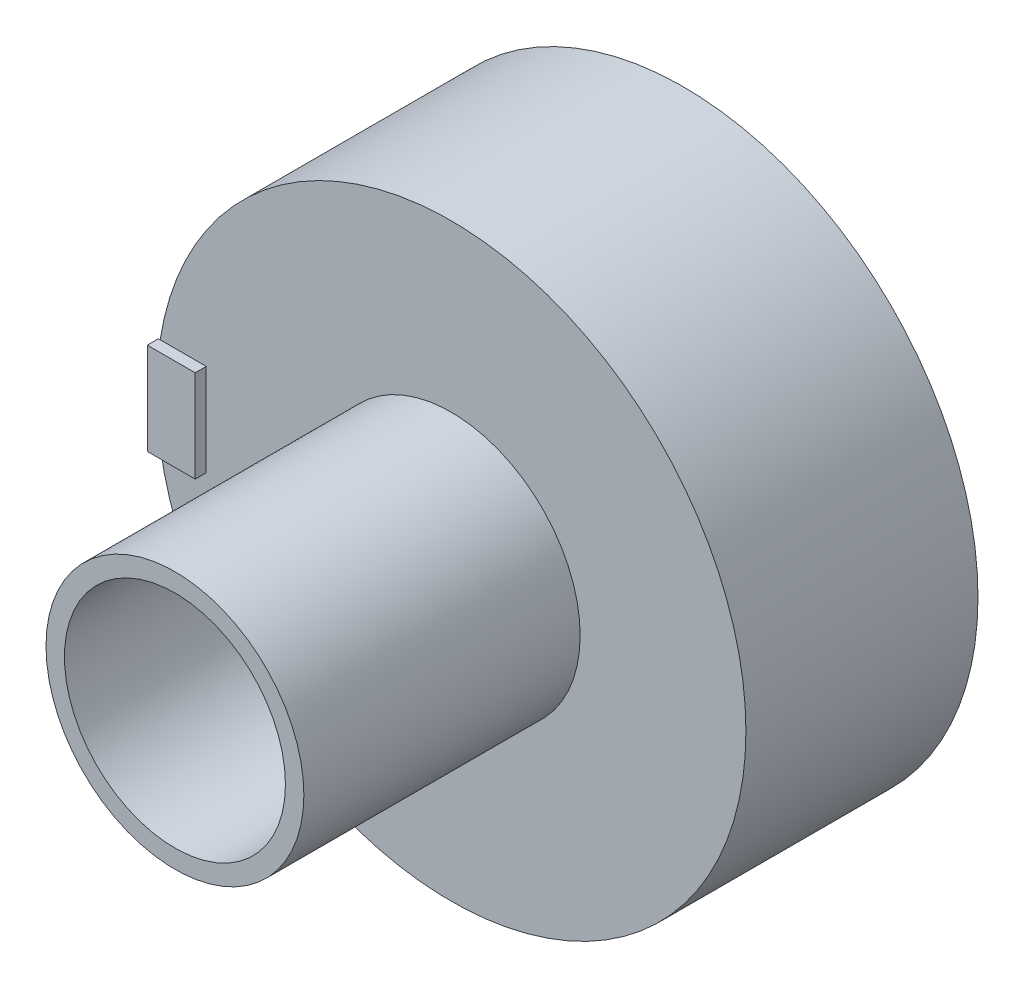
ISO-10303-21;
HEADER;
FILE_DESCRIPTION(('STEP AP214'),'2;1');
FILE_NAME('part.step','',(''),(''),'','','');
FILE_SCHEMA(('AUTOMOTIVE_DESIGN { 1 0 10303 214 1 1 1 1 }'));
ENDSEC;
DATA;
#1=APPLICATION_CONTEXT('core data for automotive mechanical design processes');
#2=APPLICATION_PROTOCOL_DEFINITION('international standard','automotive_design',2000,#1);
#3=PRODUCT_CONTEXT('',#1,'mechanical');
#4=PRODUCT('Part','Part','',(#3));
#5=PRODUCT_RELATED_PRODUCT_CATEGORY('part','',(#4));
#6=PRODUCT_DEFINITION_FORMATION('','',#4);
#7=PRODUCT_DEFINITION_CONTEXT('part definition',#1,'design');
#8=PRODUCT_DEFINITION('design','',#6,#7);
#9=PRODUCT_DEFINITION_SHAPE('','',#8);
#10=(LENGTH_UNIT() NAMED_UNIT(*) SI_UNIT(.MILLI.,.METRE.));
#11=(NAMED_UNIT(*) PLANE_ANGLE_UNIT() SI_UNIT($,.RADIAN.));
#12=(NAMED_UNIT(*) SI_UNIT($,.STERADIAN.) SOLID_ANGLE_UNIT());
#13=UNCERTAINTY_MEASURE_WITH_UNIT(LENGTH_MEASURE(1.E-05),#10,'distance_accuracy_value','');
#14=(GEOMETRIC_REPRESENTATION_CONTEXT(3) GLOBAL_UNCERTAINTY_ASSIGNED_CONTEXT((#13)) GLOBAL_UNIT_ASSIGNED_CONTEXT((#10,
#11,#12)) REPRESENTATION_CONTEXT('',''));
#15=CARTESIAN_POINT('',(0.,0.,0.));
#16=DIRECTION('',(0.,0.,1.));
#17=DIRECTION('',(1.,0.,0.));
#18=AXIS2_PLACEMENT_3D('',#15,#16,#17);
#19=CARTESIAN_POINT('',(0.,0.,6.3));
#20=DIRECTION('',(0.,0.,1.));
#21=DIRECTION('',(1.,0.,0.));
#22=AXIS2_PLACEMENT_3D('',#19,#20,#21);
#23=PLANE('',#22);
#24=CARTESIAN_POINT('',(0.,0.,6.3));
#25=DIRECTION('',(0.,0.,1.));
#26=DIRECTION('',(1.,0.,0.));
#27=AXIS2_PLACEMENT_3D('',#24,#25,#26);
#28=CIRCLE('',#27,8.);
#29=CARTESIAN_POINT('',(-7.95,0.893028554974594,6.3));
#30=VERTEX_POINT('',#29);
#31=CARTESIAN_POINT('',(-7.95,-0.893028554974605,6.3));
#32=VERTEX_POINT('',#31);
#33=EDGE_CURVE('E129',#30,#32,#28,.T.);
#34=ORIENTED_EDGE('',*,*,#33,.T.);
#35=DIRECTION('',(0.,1.,0.));
#36=VECTOR('',#35,1.);
#37=CARTESIAN_POINT('',(-7.95,0.,6.3));
#38=LINE('',#37,#36);
#39=EDGE_CURVE('E11',#32,#30,#38,.T.);
#40=ORIENTED_EDGE('',*,*,#39,.T.);
#41=EDGE_LOOP('',(#34,#40));
#42=FACE_BOUND('',#41,.T.);
#43=ADVANCED_FACE('F32',(#42),#23,.T.);
#44=CARTESIAN_POINT('',(0.,0.,6.3));
#45=DIRECTION('',(0.,0.,1.));
#46=DIRECTION('',(1.,0.,0.));
#47=AXIS2_PLACEMENT_3D('',#44,#45,#46);
#48=CIRCLE('',#47,3.5);
#49=CARTESIAN_POINT('',(3.5,0.,6.3));
#50=VERTEX_POINT('',#49);
#51=EDGE_CURVE('E120',#50,#50,#48,.T.);
#52=ORIENTED_EDGE('',*,*,#51,.F.);
#53=EDGE_LOOP('',(#52));
#54=FACE_BOUND('',#53,.T.);
#55=DIRECTION('',(0.,1.,0.));
#56=VECTOR('',#55,1.);
#57=CARTESIAN_POINT('',(-6.65,1.25,6.3));
#58=LINE('',#57,#56);
#59=CARTESIAN_POINT('',(-6.65,-1.25,6.3));
#60=VERTEX_POINT('',#59);
#61=CARTESIAN_POINT('',(-6.65,1.25,6.3));
#62=VERTEX_POINT('',#61);
#63=EDGE_CURVE('E140',#60,#62,#58,.T.);
#64=ORIENTED_EDGE('',*,*,#63,.F.);
#65=DIRECTION('',(-1.,0.,0.));
#66=VECTOR('',#65,1.);
#67=CARTESIAN_POINT('',(0.,-1.25,6.3));
#68=LINE('',#67,#66);
#69=CARTESIAN_POINT('',(-7.90174031463955,-1.25,6.3));
#70=VERTEX_POINT('',#69);
#71=EDGE_CURVE('E40',#60,#70,#68,.T.);
#72=ORIENTED_EDGE('',*,*,#71,.T.);
#73=CARTESIAN_POINT('',(-7.90174031463955,1.25,6.3));
#74=VERTEX_POINT('',#73);
#75=EDGE_CURVE('E130',#70,#74,#28,.T.);
#76=ORIENTED_EDGE('',*,*,#75,.T.);
#77=DIRECTION('',(-1.,0.,0.));
#78=VECTOR('',#77,1.);
#79=CARTESIAN_POINT('',(-7.95,1.25,6.3));
#80=LINE('',#79,#78);
#81=EDGE_CURVE('E106',#62,#74,#80,.T.);
#82=ORIENTED_EDGE('',*,*,#81,.F.);
#83=EDGE_LOOP('',(#64,#72,#76,#82));
#84=FACE_BOUND('',#83,.T.);
#85=ADVANCED_FACE('F137',(#54,#84),#23,.T.);
#86=CARTESIAN_POINT('',(0.,0.,6.3));
#87=DIRECTION('',(0.,0.,-1.));
#88=DIRECTION('',(-1.,0.,0.));
#89=AXIS2_PLACEMENT_3D('',#86,#87,#88);
#90=CYLINDRICAL_SURFACE('',#89,8.);
#91=EDGE_CURVE('E127',#74,#30,#28,.T.);
#92=ORIENTED_EDGE('',*,*,#91,.F.);
#93=ORIENTED_EDGE('',*,*,#75,.F.);
#94=EDGE_CURVE('E145',#32,#70,#28,.T.);
#95=ORIENTED_EDGE('',*,*,#94,.F.);
#96=ORIENTED_EDGE('',*,*,#33,.F.);
#97=EDGE_LOOP('',(#92,#93,#95,#96));
#98=FACE_BOUND('',#97,.T.);
#99=CARTESIAN_POINT('',(0.,0.,0.));
#100=DIRECTION('',(0.,0.,1.));
#101=DIRECTION('',(1.,0.,0.));
#102=AXIS2_PLACEMENT_3D('',#99,#100,#101);
#103=CIRCLE('',#102,8.);
#104=CARTESIAN_POINT('',(8.,0.,0.));
#105=VERTEX_POINT('',#104);
#106=EDGE_CURVE('E124',#105,#105,#103,.T.);
#107=ORIENTED_EDGE('',*,*,#106,.T.);
#108=EDGE_LOOP('',(#107));
#109=FACE_BOUND('',#108,.T.);
#110=ADVANCED_FACE('F34',(#98,#109),#90,.T.);
#111=CARTESIAN_POINT('',(0.,0.,0.));
#112=DIRECTION('',(0.,0.,1.));
#113=DIRECTION('',(1.,0.,0.));
#114=AXIS2_PLACEMENT_3D('',#111,#112,#113);
#115=PLANE('',#114);
#116=ORIENTED_EDGE('',*,*,#106,.F.);
#117=EDGE_LOOP('',(#116));
#118=FACE_BOUND('',#117,.T.);
#119=ADVANCED_FACE('F189',(#118),#115,.F.);
#120=CARTESIAN_POINT('',(0.,0.,13.8));
#121=DIRECTION('',(0.,0.,-1.));
#122=DIRECTION('',(-1.,0.,0.));
#123=AXIS2_PLACEMENT_3D('',#120,#121,#122);
#124=CYLINDRICAL_SURFACE('',#123,3.5);
#125=CARTESIAN_POINT('',(0.,0.,13.8));
#126=DIRECTION('',(0.,0.,1.));
#127=DIRECTION('',(1.,0.,0.));
#128=AXIS2_PLACEMENT_3D('',#125,#126,#127);
#129=CIRCLE('',#128,3.5);
#130=CARTESIAN_POINT('',(3.5,0.,13.8));
#131=VERTEX_POINT('',#130);
#132=EDGE_CURVE('E121',#131,#131,#129,.T.);
#133=ORIENTED_EDGE('',*,*,#132,.F.);
#134=EDGE_LOOP('',(#133));
#135=FACE_BOUND('',#134,.T.);
#136=ORIENTED_EDGE('',*,*,#51,.T.);
#137=EDGE_LOOP('',(#136));
#138=FACE_BOUND('',#137,.T.);
#139=ADVANCED_FACE('F187',(#135,#138),#124,.T.);
#140=CARTESIAN_POINT('',(0.,0.,13.8));
#141=DIRECTION('',(0.,0.,1.));
#142=DIRECTION('',(1.,0.,0.));
#143=AXIS2_PLACEMENT_3D('',#140,#141,#142);
#144=PLANE('',#143);
#145=CARTESIAN_POINT('',(0.,0.,13.8));
#146=DIRECTION('',(0.,0.,1.));
#147=DIRECTION('',(1.,0.,0.));
#148=AXIS2_PLACEMENT_3D('',#145,#146,#147);
#149=CIRCLE('',#148,3.);
#150=CARTESIAN_POINT('',(3.,0.,13.8));
#151=VERTEX_POINT('',#150);
#152=EDGE_CURVE('E110',#151,#151,#149,.T.);
#153=ORIENTED_EDGE('',*,*,#152,.F.);
#154=EDGE_LOOP('',(#153));
#155=FACE_BOUND('',#154,.T.);
#156=ORIENTED_EDGE('',*,*,#132,.T.);
#157=EDGE_LOOP('',(#156));
#158=FACE_BOUND('',#157,.T.);
#159=ADVANCED_FACE('F196',(#155,#158),#144,.T.);
#160=CARTESIAN_POINT('',(0.,0.,-2.18528137423857));
#161=DIRECTION('',(0.,0.,1.));
#162=DIRECTION('',(1.,0.,0.));
#163=AXIS2_PLACEMENT_3D('',#160,#161,#162);
#164=CYLINDRICAL_SURFACE('',#163,3.);
#165=CARTESIAN_POINT('',(0.,0.,6.3));
#166=DIRECTION('',(0.,0.,1.));
#167=DIRECTION('',(1.,0.,0.));
#168=AXIS2_PLACEMENT_3D('',#165,#166,#167);
#169=CIRCLE('',#168,3.);
#170=CARTESIAN_POINT('',(3.,0.,6.3));
#171=VERTEX_POINT('',#170);
#172=EDGE_CURVE('E113',#171,#171,#169,.F.);
#173=ORIENTED_EDGE('',*,*,#172,.T.);
#174=EDGE_LOOP('',(#173));
#175=FACE_BOUND('',#174,.T.);
#176=ORIENTED_EDGE('',*,*,#152,.T.);
#177=EDGE_LOOP('',(#176));
#178=FACE_BOUND('',#177,.T.);
#179=ADVANCED_FACE('F174',(#175,#178),#164,.F.);
#180=CARTESIAN_POINT('',(0.,0.,6.3));
#181=DIRECTION('',(0.,0.,1.));
#182=DIRECTION('',(1.,0.,0.));
#183=AXIS2_PLACEMENT_3D('',#180,#181,#182);
#184=PLANE('',#183);
#185=ORIENTED_EDGE('',*,*,#172,.F.);
#186=EDGE_LOOP('',(#185));
#187=FACE_BOUND('',#186,.T.);
#188=ADVANCED_FACE('F166',(#187),#184,.T.);
#189=CARTESIAN_POINT('',(0.,0.,6.3));
#190=DIRECTION('',(0.,0.,1.));
#191=DIRECTION('',(1.,0.,0.));
#192=AXIS2_PLACEMENT_3D('',#189,#190,#191);
#193=PLANE('',#192);
#194=CARTESIAN_POINT('',(-7.95,1.25,6.3));
#195=VERTEX_POINT('',#194);
#196=EDGE_CURVE('E159',#74,#195,#80,.T.);
#197=ORIENTED_EDGE('',*,*,#196,.F.);
#198=ORIENTED_EDGE('',*,*,#91,.T.);
#199=DIRECTION('',(0.,-1.,0.));
#200=VECTOR('',#199,1.);
#201=CARTESIAN_POINT('',(-7.95,1.25,6.3));
#202=LINE('',#201,#200);
#203=EDGE_CURVE('E149',#195,#30,#202,.T.);
#204=ORIENTED_EDGE('',*,*,#203,.F.);
#205=EDGE_LOOP('',(#197,#198,#204));
#206=FACE_BOUND('',#205,.T.);
#207=ADVANCED_FACE('F164',(#206),#193,.F.);
#208=CARTESIAN_POINT('',(-7.95,1.25,6.6));
#209=DIRECTION('',(1.,0.,0.));
#210=DIRECTION('',(0.,1.,0.));
#211=AXIS2_PLACEMENT_3D('',#208,#209,#210);
#212=PLANE('',#211);
#213=ORIENTED_EDGE('',*,*,#203,.T.);
#214=ORIENTED_EDGE('',*,*,#39,.F.);
#215=CARTESIAN_POINT('',(-7.95,-1.25,6.3));
#216=VERTEX_POINT('',#215);
#217=EDGE_CURVE('E55',#32,#216,#202,.T.);
#218=ORIENTED_EDGE('',*,*,#217,.T.);
#219=DIRECTION('',(0.,0.,-1.));
#220=VECTOR('',#219,1.);
#221=CARTESIAN_POINT('',(-7.95,-1.25,6.6));
#222=LINE('',#221,#220);
#223=CARTESIAN_POINT('',(-7.95,-1.25,6.6));
#224=VERTEX_POINT('',#223);
#225=EDGE_CURVE('E92',#224,#216,#222,.T.);
#226=ORIENTED_EDGE('',*,*,#225,.F.);
#227=DIRECTION('',(0.,-1.,0.));
#228=VECTOR('',#227,1.);
#229=CARTESIAN_POINT('',(-7.95,1.25,6.6));
#230=LINE('',#229,#228);
#231=CARTESIAN_POINT('',(-7.95,1.25,6.6));
#232=VERTEX_POINT('',#231);
#233=EDGE_CURVE('E98',#232,#224,#230,.T.);
#234=ORIENTED_EDGE('',*,*,#233,.F.);
#235=DIRECTION('',(0.,0.,-1.));
#236=VECTOR('',#235,1.);
#237=CARTESIAN_POINT('',(-7.95,1.25,6.6));
#238=LINE('',#237,#236);
#239=EDGE_CURVE('E150',#232,#195,#238,.T.);
#240=ORIENTED_EDGE('',*,*,#239,.T.);
#241=EDGE_LOOP('',(#213,#214,#218,#226,#234,#240));
#242=FACE_BOUND('',#241,.T.);
#243=ADVANCED_FACE('F109',(#242),#212,.F.);
#244=CARTESIAN_POINT('',(-7.95,-1.25,6.6));
#245=DIRECTION('',(0.,1.,0.));
#246=DIRECTION('',(-1.,0.,0.));
#247=AXIS2_PLACEMENT_3D('',#244,#245,#246);
#248=PLANE('',#247);
#249=DIRECTION('',(1.,0.,0.));
#250=VECTOR('',#249,1.);
#251=CARTESIAN_POINT('',(-7.95,-1.25,6.3));
#252=LINE('',#251,#250);
#253=EDGE_CURVE('E152',#216,#70,#252,.T.);
#254=ORIENTED_EDGE('',*,*,#253,.T.);
#255=ORIENTED_EDGE('',*,*,#71,.F.);
#256=DIRECTION('',(0.,0.,-1.));
#257=VECTOR('',#256,1.);
#258=CARTESIAN_POINT('',(-6.65,-1.25,6.6));
#259=LINE('',#258,#257);
#260=CARTESIAN_POINT('',(-6.65,-1.25,6.6));
#261=VERTEX_POINT('',#260);
#262=EDGE_CURVE('E94',#261,#60,#259,.T.);
#263=ORIENTED_EDGE('',*,*,#262,.F.);
#264=DIRECTION('',(1.,0.,0.));
#265=VECTOR('',#264,1.);
#266=CARTESIAN_POINT('',(-7.95,-1.25,6.6));
#267=LINE('',#266,#265);
#268=EDGE_CURVE('E87',#224,#261,#267,.T.);
#269=ORIENTED_EDGE('',*,*,#268,.F.);
#270=ORIENTED_EDGE('',*,*,#225,.T.);
#271=EDGE_LOOP('',(#254,#255,#263,#269,#270));
#272=FACE_BOUND('',#271,.T.);
#273=ADVANCED_FACE('F90',(#272),#248,.F.);
#274=CARTESIAN_POINT('',(-6.65,1.25,6.6));
#275=DIRECTION('',(-1.,0.,0.));
#276=DIRECTION('',(0.,-1.,0.));
#277=AXIS2_PLACEMENT_3D('',#274,#275,#276);
#278=PLANE('',#277);
#279=ORIENTED_EDGE('',*,*,#63,.T.);
#280=DIRECTION('',(0.,0.,-1.));
#281=VECTOR('',#280,1.);
#282=CARTESIAN_POINT('',(-6.65,1.25,6.6));
#283=LINE('',#282,#281);
#284=CARTESIAN_POINT('',(-6.65,1.25,6.6));
#285=VERTEX_POINT('',#284);
#286=EDGE_CURVE('E47',#285,#62,#283,.T.);
#287=ORIENTED_EDGE('',*,*,#286,.F.);
#288=DIRECTION('',(0.,1.,0.));
#289=VECTOR('',#288,1.);
#290=CARTESIAN_POINT('',(-6.65,1.25,6.6));
#291=LINE('',#290,#289);
#292=EDGE_CURVE('E97',#261,#285,#291,.T.);
#293=ORIENTED_EDGE('',*,*,#292,.F.);
#294=ORIENTED_EDGE('',*,*,#262,.T.);
#295=EDGE_LOOP('',(#279,#287,#293,#294));
#296=FACE_BOUND('',#295,.T.);
#297=ADVANCED_FACE('F162',(#296),#278,.F.);
#298=CARTESIAN_POINT('',(-7.95,1.25,6.6));
#299=DIRECTION('',(0.,-1.,0.));
#300=DIRECTION('',(1.,0.,0.));
#301=AXIS2_PLACEMENT_3D('',#298,#299,#300);
#302=PLANE('',#301);
#303=ORIENTED_EDGE('',*,*,#81,.T.);
#304=ORIENTED_EDGE('',*,*,#196,.T.);
#305=ORIENTED_EDGE('',*,*,#239,.F.);
#306=DIRECTION('',(-1.,0.,0.));
#307=VECTOR('',#306,1.);
#308=CARTESIAN_POINT('',(-7.95,1.25,6.6));
#309=LINE('',#308,#307);
#310=EDGE_CURVE('E102',#285,#232,#309,.T.);
#311=ORIENTED_EDGE('',*,*,#310,.F.);
#312=ORIENTED_EDGE('',*,*,#286,.T.);
#313=EDGE_LOOP('',(#303,#304,#305,#311,#312));
#314=FACE_BOUND('',#313,.T.);
#315=ADVANCED_FACE('F163',(#314),#302,.F.);
#316=CARTESIAN_POINT('',(0.,0.,6.6));
#317=DIRECTION('',(0.,0.,1.));
#318=DIRECTION('',(1.,0.,0.));
#319=AXIS2_PLACEMENT_3D('',#316,#317,#318);
#320=PLANE('',#319);
#321=ORIENTED_EDGE('',*,*,#233,.T.);
#322=ORIENTED_EDGE('',*,*,#268,.T.);
#323=ORIENTED_EDGE('',*,*,#292,.T.);
#324=ORIENTED_EDGE('',*,*,#310,.T.);
#325=EDGE_LOOP('',(#321,#322,#323,#324));
#326=FACE_BOUND('',#325,.T.);
#327=ADVANCED_FACE('F101',(#326),#320,.T.);
#328=ORIENTED_EDGE('',*,*,#217,.F.);
#329=ORIENTED_EDGE('',*,*,#94,.T.);
#330=ORIENTED_EDGE('',*,*,#253,.F.);
#331=EDGE_LOOP('',(#328,#329,#330));
#332=FACE_BOUND('',#331,.T.);
#333=ADVANCED_FACE('F168',(#332),#193,.F.);
#334=CLOSED_SHELL('',(#43,#85,#110,#119,#139,#159,#179,#188,#207,#243,#273,#297,#315,#327,#333));
#335=MANIFOLD_SOLID_BREP('B2',#334);
#336=ADVANCED_BREP_SHAPE_REPRESENTATION('',(#18,#335),#14);
#337=SHAPE_DEFINITION_REPRESENTATION(#9,#336);
ENDSEC;
END-ISO-10303-21;
